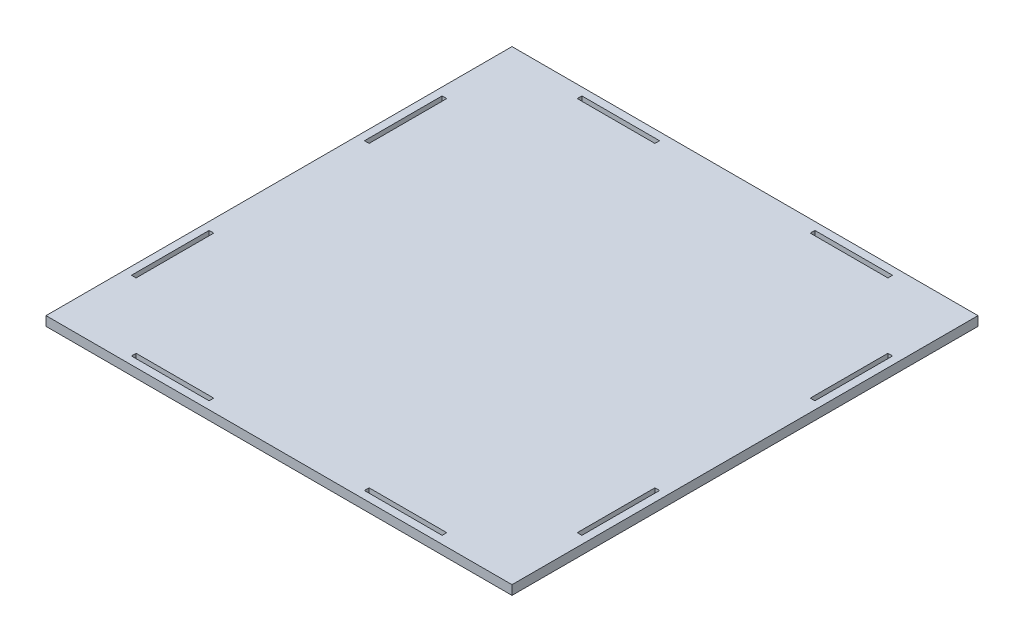
ISO-10303-21;
HEADER;
FILE_DESCRIPTION(('STEP AP214'),'2;1');
FILE_NAME('part.step','',(''),(''),'','','');
FILE_SCHEMA(('AUTOMOTIVE_DESIGN { 1 0 10303 214 1 1 1 1 }'));
ENDSEC;
DATA;
#1=APPLICATION_CONTEXT('core data for automotive mechanical design processes');
#2=APPLICATION_PROTOCOL_DEFINITION('international standard','automotive_design',2000,#1);
#3=PRODUCT_CONTEXT('',#1,'mechanical');
#4=PRODUCT('Part','Part','',(#3));
#5=PRODUCT_RELATED_PRODUCT_CATEGORY('part','',(#4));
#6=PRODUCT_DEFINITION_FORMATION('','',#4);
#7=PRODUCT_DEFINITION_CONTEXT('part definition',#1,'design');
#8=PRODUCT_DEFINITION('design','',#6,#7);
#9=PRODUCT_DEFINITION_SHAPE('','',#8);
#10=(LENGTH_UNIT() NAMED_UNIT(*) SI_UNIT(.MILLI.,.METRE.));
#11=(NAMED_UNIT(*) PLANE_ANGLE_UNIT() SI_UNIT($,.RADIAN.));
#12=(NAMED_UNIT(*) SI_UNIT($,.STERADIAN.) SOLID_ANGLE_UNIT());
#13=UNCERTAINTY_MEASURE_WITH_UNIT(LENGTH_MEASURE(1.E-05),#10,'distance_accuracy_value','');
#14=(GEOMETRIC_REPRESENTATION_CONTEXT(3) GLOBAL_UNCERTAINTY_ASSIGNED_CONTEXT((#13)) GLOBAL_UNIT_ASSIGNED_CONTEXT((#10,
#11,#12)) REPRESENTATION_CONTEXT('',''));
#15=CARTESIAN_POINT('',(0.,0.,0.));
#16=DIRECTION('',(0.,0.,1.));
#17=DIRECTION('',(1.,0.,0.));
#18=AXIS2_PLACEMENT_3D('',#15,#16,#17);
#19=CARTESIAN_POINT('',(0.,6.,0.));
#20=DIRECTION('',(0.,1.,0.));
#21=DIRECTION('',(0.,0.,1.));
#22=AXIS2_PLACEMENT_3D('',#19,#20,#21);
#23=PLANE('',#22);
#24=DIRECTION('',(0.,0.,-1.));
#25=VECTOR('',#24,1.);
#26=CARTESIAN_POINT('',(150.,6.,-150.));
#27=LINE('',#26,#25);
#28=CARTESIAN_POINT('',(150.,6.,150.));
#29=VERTEX_POINT('',#28);
#30=CARTESIAN_POINT('',(150.,6.,-150.));
#31=VERTEX_POINT('',#30);
#32=EDGE_CURVE('E518',#29,#31,#27,.T.);
#33=ORIENTED_EDGE('',*,*,#32,.T.);
#34=DIRECTION('',(-1.,0.,0.));
#35=VECTOR('',#34,1.);
#36=CARTESIAN_POINT('',(-150.,6.,-150.));
#37=LINE('',#36,#35);
#38=CARTESIAN_POINT('',(-150.,6.,-150.));
#39=VERTEX_POINT('',#38);
#40=EDGE_CURVE('E521',#31,#39,#37,.T.);
#41=ORIENTED_EDGE('',*,*,#40,.T.);
#42=DIRECTION('',(0.,0.,1.));
#43=VECTOR('',#42,1.);
#44=CARTESIAN_POINT('',(-150.,6.,-150.));
#45=LINE('',#44,#43);
#46=CARTESIAN_POINT('',(-150.,6.,150.));
#47=VERTEX_POINT('',#46);
#48=EDGE_CURVE('E524',#39,#47,#45,.T.);
#49=ORIENTED_EDGE('',*,*,#48,.T.);
#50=DIRECTION('',(1.,0.,0.));
#51=VECTOR('',#50,1.);
#52=CARTESIAN_POINT('',(-150.,6.,150.));
#53=LINE('',#52,#51);
#54=EDGE_CURVE('E526',#47,#29,#53,.T.);
#55=ORIENTED_EDGE('',*,*,#54,.T.);
#56=EDGE_LOOP('',(#33,#41,#49,#55));
#57=FACE_BOUND('',#56,.T.);
#58=DIRECTION('',(1.,0.,0.));
#59=VECTOR('',#58,1.);
#60=CARTESIAN_POINT('',(-50.,6.,-142.));
#61=LINE('',#60,#59);
#62=CARTESIAN_POINT('',(-100.,6.,-142.));
#63=VERTEX_POINT('',#62);
#64=CARTESIAN_POINT('',(-50.,6.,-142.));
#65=VERTEX_POINT('',#64);
#66=EDGE_CURVE('E489',#63,#65,#61,.T.);
#67=ORIENTED_EDGE('',*,*,#66,.F.);
#68=DIRECTION('',(0.,0.,1.));
#69=VECTOR('',#68,1.);
#70=CARTESIAN_POINT('',(-100.,6.,-142.));
#71=LINE('',#70,#69);
#72=CARTESIAN_POINT('',(-100.,6.,-145.));
#73=VERTEX_POINT('',#72);
#74=EDGE_CURVE('E487',#73,#63,#71,.T.);
#75=ORIENTED_EDGE('',*,*,#74,.F.);
#76=DIRECTION('',(-1.,0.,0.));
#77=VECTOR('',#76,1.);
#78=CARTESIAN_POINT('',(-100.,6.,-145.));
#79=LINE('',#78,#77);
#80=CARTESIAN_POINT('',(-50.,6.,-145.));
#81=VERTEX_POINT('',#80);
#82=EDGE_CURVE('E495',#81,#73,#79,.T.);
#83=ORIENTED_EDGE('',*,*,#82,.F.);
#84=DIRECTION('',(0.,0.,-1.));
#85=VECTOR('',#84,1.);
#86=CARTESIAN_POINT('',(-50.,6.,-145.));
#87=LINE('',#86,#85);
#88=EDGE_CURVE('E492',#65,#81,#87,.T.);
#89=ORIENTED_EDGE('',*,*,#88,.F.);
#90=EDGE_LOOP('',(#67,#75,#83,#89));
#91=FACE_BOUND('',#90,.T.);
#92=DIRECTION('',(0.,0.,1.));
#93=VECTOR('',#92,1.);
#94=CARTESIAN_POINT('',(50.,6.,-145.));
#95=LINE('',#94,#93);
#96=CARTESIAN_POINT('',(50.,6.,-145.));
#97=VERTEX_POINT('',#96);
#98=CARTESIAN_POINT('',(50.,6.,-142.));
#99=VERTEX_POINT('',#98);
#100=EDGE_CURVE('E458',#97,#99,#95,.T.);
#101=ORIENTED_EDGE('',*,*,#100,.F.);
#102=DIRECTION('',(-1.,0.,0.));
#103=VECTOR('',#102,1.);
#104=CARTESIAN_POINT('',(100.,6.,-145.));
#105=LINE('',#104,#103);
#106=CARTESIAN_POINT('',(100.,6.,-145.));
#107=VERTEX_POINT('',#106);
#108=EDGE_CURVE('E456',#107,#97,#105,.T.);
#109=ORIENTED_EDGE('',*,*,#108,.F.);
#110=DIRECTION('',(0.,0.,-1.));
#111=VECTOR('',#110,1.);
#112=CARTESIAN_POINT('',(100.,6.,-142.));
#113=LINE('',#112,#111);
#114=CARTESIAN_POINT('',(100.,6.,-142.));
#115=VERTEX_POINT('',#114);
#116=EDGE_CURVE('E464',#115,#107,#113,.T.);
#117=ORIENTED_EDGE('',*,*,#116,.F.);
#118=DIRECTION('',(1.,0.,0.));
#119=VECTOR('',#118,1.);
#120=CARTESIAN_POINT('',(50.,6.,-142.));
#121=LINE('',#120,#119);
#122=EDGE_CURVE('E461',#99,#115,#121,.T.);
#123=ORIENTED_EDGE('',*,*,#122,.F.);
#124=EDGE_LOOP('',(#101,#109,#117,#123));
#125=FACE_BOUND('',#124,.T.);
#126=DIRECTION('',(0.,0.,-1.));
#127=VECTOR('',#126,1.);
#128=CARTESIAN_POINT('',(145.,6.,100.));
#129=LINE('',#128,#127);
#130=CARTESIAN_POINT('',(145.,6.,100.));
#131=VERTEX_POINT('',#130);
#132=CARTESIAN_POINT('',(145.,6.,50.));
#133=VERTEX_POINT('',#132);
#134=EDGE_CURVE('E427',#131,#133,#129,.T.);
#135=ORIENTED_EDGE('',*,*,#134,.F.);
#136=DIRECTION('',(1.,0.,0.));
#137=VECTOR('',#136,1.);
#138=CARTESIAN_POINT('',(145.,6.,100.));
#139=LINE('',#138,#137);
#140=CARTESIAN_POINT('',(142.,6.,100.));
#141=VERTEX_POINT('',#140);
#142=EDGE_CURVE('E425',#141,#131,#139,.T.);
#143=ORIENTED_EDGE('',*,*,#142,.F.);
#144=DIRECTION('',(0.,0.,1.));
#145=VECTOR('',#144,1.);
#146=CARTESIAN_POINT('',(142.,6.,100.));
#147=LINE('',#146,#145);
#148=CARTESIAN_POINT('',(142.,6.,50.));
#149=VERTEX_POINT('',#148);
#150=EDGE_CURVE('E433',#149,#141,#147,.T.);
#151=ORIENTED_EDGE('',*,*,#150,.F.);
#152=DIRECTION('',(-1.,0.,0.));
#153=VECTOR('',#152,1.);
#154=CARTESIAN_POINT('',(142.,6.,50.));
#155=LINE('',#154,#153);
#156=EDGE_CURVE('E430',#133,#149,#155,.T.);
#157=ORIENTED_EDGE('',*,*,#156,.F.);
#158=EDGE_LOOP('',(#135,#143,#151,#157));
#159=FACE_BOUND('',#158,.T.);
#160=DIRECTION('',(0.,0.,-1.));
#161=VECTOR('',#160,1.);
#162=CARTESIAN_POINT('',(145.,6.,-100.));
#163=LINE('',#162,#161);
#164=CARTESIAN_POINT('',(145.,6.,-50.));
#165=VERTEX_POINT('',#164);
#166=CARTESIAN_POINT('',(145.,6.,-100.));
#167=VERTEX_POINT('',#166);
#168=EDGE_CURVE('E396',#165,#167,#163,.T.);
#169=ORIENTED_EDGE('',*,*,#168,.F.);
#170=DIRECTION('',(1.,0.,0.));
#171=VECTOR('',#170,1.);
#172=CARTESIAN_POINT('',(145.,6.,-50.));
#173=LINE('',#172,#171);
#174=CARTESIAN_POINT('',(142.,6.,-50.));
#175=VERTEX_POINT('',#174);
#176=EDGE_CURVE('E394',#175,#165,#173,.T.);
#177=ORIENTED_EDGE('',*,*,#176,.F.);
#178=DIRECTION('',(0.,0.,1.));
#179=VECTOR('',#178,1.);
#180=CARTESIAN_POINT('',(142.,6.,-50.));
#181=LINE('',#180,#179);
#182=CARTESIAN_POINT('',(142.,6.,-100.));
#183=VERTEX_POINT('',#182);
#184=EDGE_CURVE('E402',#183,#175,#181,.T.);
#185=ORIENTED_EDGE('',*,*,#184,.F.);
#186=DIRECTION('',(-1.,0.,0.));
#187=VECTOR('',#186,1.);
#188=CARTESIAN_POINT('',(142.,6.,-100.));
#189=LINE('',#188,#187);
#190=EDGE_CURVE('E399',#167,#183,#189,.T.);
#191=ORIENTED_EDGE('',*,*,#190,.F.);
#192=EDGE_LOOP('',(#169,#177,#185,#191));
#193=FACE_BOUND('',#192,.T.);
#194=DIRECTION('',(-1.,0.,0.));
#195=VECTOR('',#194,1.);
#196=CARTESIAN_POINT('',(-142.,6.,50.));
#197=LINE('',#196,#195);
#198=CARTESIAN_POINT('',(-142.,6.,50.));
#199=VERTEX_POINT('',#198);
#200=CARTESIAN_POINT('',(-145.,6.,50.));
#201=VERTEX_POINT('',#200);
#202=EDGE_CURVE('E365',#199,#201,#197,.T.);
#203=ORIENTED_EDGE('',*,*,#202,.F.);
#204=DIRECTION('',(0.,0.,-1.));
#205=VECTOR('',#204,1.);
#206=CARTESIAN_POINT('',(-142.,6.,100.));
#207=LINE('',#206,#205);
#208=CARTESIAN_POINT('',(-142.,6.,100.));
#209=VERTEX_POINT('',#208);
#210=EDGE_CURVE('E363',#209,#199,#207,.T.);
#211=ORIENTED_EDGE('',*,*,#210,.F.);
#212=DIRECTION('',(1.,0.,0.));
#213=VECTOR('',#212,1.);
#214=CARTESIAN_POINT('',(-145.,6.,100.));
#215=LINE('',#214,#213);
#216=CARTESIAN_POINT('',(-145.,6.,100.));
#217=VERTEX_POINT('',#216);
#218=EDGE_CURVE('E371',#217,#209,#215,.T.);
#219=ORIENTED_EDGE('',*,*,#218,.F.);
#220=DIRECTION('',(0.,0.,1.));
#221=VECTOR('',#220,1.);
#222=CARTESIAN_POINT('',(-145.,6.,50.));
#223=LINE('',#222,#221);
#224=EDGE_CURVE('E368',#201,#217,#223,.T.);
#225=ORIENTED_EDGE('',*,*,#224,.F.);
#226=EDGE_LOOP('',(#203,#211,#219,#225));
#227=FACE_BOUND('',#226,.T.);
#228=DIRECTION('',(0.,0.,1.));
#229=VECTOR('',#228,1.);
#230=CARTESIAN_POINT('',(50.,6.,142.));
#231=LINE('',#230,#229);
#232=CARTESIAN_POINT('',(50.,6.,142.));
#233=VERTEX_POINT('',#232);
#234=CARTESIAN_POINT('',(50.,6.,145.));
#235=VERTEX_POINT('',#234);
#236=EDGE_CURVE('E334',#233,#235,#231,.T.);
#237=ORIENTED_EDGE('',*,*,#236,.F.);
#238=DIRECTION('',(-1.,0.,0.));
#239=VECTOR('',#238,1.);
#240=CARTESIAN_POINT('',(100.,6.,142.));
#241=LINE('',#240,#239);
#242=CARTESIAN_POINT('',(100.,6.,142.));
#243=VERTEX_POINT('',#242);
#244=EDGE_CURVE('E332',#243,#233,#241,.T.);
#245=ORIENTED_EDGE('',*,*,#244,.F.);
#246=DIRECTION('',(0.,0.,-1.));
#247=VECTOR('',#246,1.);
#248=CARTESIAN_POINT('',(100.,6.,145.));
#249=LINE('',#248,#247);
#250=CARTESIAN_POINT('',(100.,6.,145.));
#251=VERTEX_POINT('',#250);
#252=EDGE_CURVE('E340',#251,#243,#249,.T.);
#253=ORIENTED_EDGE('',*,*,#252,.F.);
#254=DIRECTION('',(1.,0.,0.));
#255=VECTOR('',#254,1.);
#256=CARTESIAN_POINT('',(50.,6.,145.));
#257=LINE('',#256,#255);
#258=EDGE_CURVE('E337',#235,#251,#257,.T.);
#259=ORIENTED_EDGE('',*,*,#258,.F.);
#260=EDGE_LOOP('',(#237,#245,#253,#259));
#261=FACE_BOUND('',#260,.T.);
#262=DIRECTION('',(-1.,0.,0.));
#263=VECTOR('',#262,1.);
#264=CARTESIAN_POINT('',(-50.,6.,142.));
#265=LINE('',#264,#263);
#266=CARTESIAN_POINT('',(-50.,6.,142.));
#267=VERTEX_POINT('',#266);
#268=CARTESIAN_POINT('',(-100.,6.,142.));
#269=VERTEX_POINT('',#268);
#270=EDGE_CURVE('E303',#267,#269,#265,.T.);
#271=ORIENTED_EDGE('',*,*,#270,.F.);
#272=DIRECTION('',(0.,0.,-1.));
#273=VECTOR('',#272,1.);
#274=CARTESIAN_POINT('',(-50.,6.,145.));
#275=LINE('',#274,#273);
#276=CARTESIAN_POINT('',(-50.,6.,145.));
#277=VERTEX_POINT('',#276);
#278=EDGE_CURVE('E301',#277,#267,#275,.T.);
#279=ORIENTED_EDGE('',*,*,#278,.F.);
#280=DIRECTION('',(1.,0.,0.));
#281=VECTOR('',#280,1.);
#282=CARTESIAN_POINT('',(-100.,6.,145.));
#283=LINE('',#282,#281);
#284=CARTESIAN_POINT('',(-100.,6.,145.));
#285=VERTEX_POINT('',#284);
#286=EDGE_CURVE('E309',#285,#277,#283,.T.);
#287=ORIENTED_EDGE('',*,*,#286,.F.);
#288=DIRECTION('',(0.,0.,1.));
#289=VECTOR('',#288,1.);
#290=CARTESIAN_POINT('',(-100.,6.,142.));
#291=LINE('',#290,#289);
#292=EDGE_CURVE('E306',#269,#285,#291,.T.);
#293=ORIENTED_EDGE('',*,*,#292,.F.);
#294=EDGE_LOOP('',(#271,#279,#287,#293));
#295=FACE_BOUND('',#294,.T.);
#296=DIRECTION('',(-1.,0.,0.));
#297=VECTOR('',#296,1.);
#298=CARTESIAN_POINT('',(-145.,6.,-100.));
#299=LINE('',#298,#297);
#300=CARTESIAN_POINT('',(-142.,6.,-100.));
#301=VERTEX_POINT('',#300);
#302=CARTESIAN_POINT('',(-145.,6.,-100.));
#303=VERTEX_POINT('',#302);
#304=EDGE_CURVE('E273',#301,#303,#299,.T.);
#305=ORIENTED_EDGE('',*,*,#304,.F.);
#306=DIRECTION('',(0.,0.,-1.));
#307=VECTOR('',#306,1.);
#308=CARTESIAN_POINT('',(-142.,6.,-100.));
#309=LINE('',#308,#307);
#310=CARTESIAN_POINT('',(-142.,6.,-50.));
#311=VERTEX_POINT('',#310);
#312=EDGE_CURVE('E265',#311,#301,#309,.T.);
#313=ORIENTED_EDGE('',*,*,#312,.F.);
#314=DIRECTION('',(1.,0.,0.));
#315=VECTOR('',#314,1.);
#316=CARTESIAN_POINT('',(-142.,6.,-50.));
#317=LINE('',#316,#315);
#318=CARTESIAN_POINT('',(-145.,6.,-50.));
#319=VERTEX_POINT('',#318);
#320=EDGE_CURVE('E287',#319,#311,#317,.T.);
#321=ORIENTED_EDGE('',*,*,#320,.F.);
#322=DIRECTION('',(0.,0.,1.));
#323=VECTOR('',#322,1.);
#324=CARTESIAN_POINT('',(-145.,6.,-50.));
#325=LINE('',#324,#323);
#326=EDGE_CURVE('E285',#303,#319,#325,.T.);
#327=ORIENTED_EDGE('',*,*,#326,.F.);
#328=EDGE_LOOP('',(#305,#313,#321,#327));
#329=FACE_BOUND('',#328,.T.);
#330=ADVANCED_FACE('F32',(#57,#91,#125,#159,#193,#227,#261,#295,#329),#23,.T.);
#331=CARTESIAN_POINT('',(0.,0.,0.));
#332=DIRECTION('',(0.,1.,0.));
#333=DIRECTION('',(0.,0.,1.));
#334=AXIS2_PLACEMENT_3D('',#331,#332,#333);
#335=PLANE('',#334);
#336=DIRECTION('',(0.,0.,-1.));
#337=VECTOR('',#336,1.);
#338=CARTESIAN_POINT('',(-50.,0.,145.));
#339=LINE('',#338,#337);
#340=CARTESIAN_POINT('',(-50.,0.,145.));
#341=VERTEX_POINT('',#340);
#342=CARTESIAN_POINT('',(-50.,0.,142.));
#343=VERTEX_POINT('',#342);
#344=EDGE_CURVE('E281',#341,#343,#339,.T.);
#345=ORIENTED_EDGE('',*,*,#344,.T.);
#346=DIRECTION('',(-1.,0.,0.));
#347=VECTOR('',#346,1.);
#348=CARTESIAN_POINT('',(-50.,0.,142.));
#349=LINE('',#348,#347);
#350=CARTESIAN_POINT('',(-100.,0.,142.));
#351=VERTEX_POINT('',#350);
#352=EDGE_CURVE('E314',#343,#351,#349,.T.);
#353=ORIENTED_EDGE('',*,*,#352,.T.);
#354=DIRECTION('',(0.,0.,1.));
#355=VECTOR('',#354,1.);
#356=CARTESIAN_POINT('',(-100.,0.,142.));
#357=LINE('',#356,#355);
#358=CARTESIAN_POINT('',(-100.,0.,145.));
#359=VERTEX_POINT('',#358);
#360=EDGE_CURVE('E317',#351,#359,#357,.T.);
#361=ORIENTED_EDGE('',*,*,#360,.T.);
#362=DIRECTION('',(1.,0.,0.));
#363=VECTOR('',#362,1.);
#364=CARTESIAN_POINT('',(-100.,0.,145.));
#365=LINE('',#364,#363);
#366=EDGE_CURVE('E304',#359,#341,#365,.T.);
#367=ORIENTED_EDGE('',*,*,#366,.T.);
#368=EDGE_LOOP('',(#345,#353,#361,#367));
#369=FACE_BOUND('',#368,.T.);
#370=DIRECTION('',(0.,0.,-1.));
#371=VECTOR('',#370,1.);
#372=CARTESIAN_POINT('',(-142.,0.,100.));
#373=LINE('',#372,#371);
#374=CARTESIAN_POINT('',(-142.,0.,100.));
#375=VERTEX_POINT('',#374);
#376=CARTESIAN_POINT('',(-142.,0.,50.));
#377=VERTEX_POINT('',#376);
#378=EDGE_CURVE('E362',#375,#377,#373,.T.);
#379=ORIENTED_EDGE('',*,*,#378,.T.);
#380=DIRECTION('',(-1.,0.,0.));
#381=VECTOR('',#380,1.);
#382=CARTESIAN_POINT('',(-142.,0.,50.));
#383=LINE('',#382,#381);
#384=CARTESIAN_POINT('',(-145.,0.,50.));
#385=VERTEX_POINT('',#384);
#386=EDGE_CURVE('E376',#377,#385,#383,.T.);
#387=ORIENTED_EDGE('',*,*,#386,.T.);
#388=DIRECTION('',(0.,0.,1.));
#389=VECTOR('',#388,1.);
#390=CARTESIAN_POINT('',(-145.,0.,50.));
#391=LINE('',#390,#389);
#392=CARTESIAN_POINT('',(-145.,0.,100.));
#393=VERTEX_POINT('',#392);
#394=EDGE_CURVE('E379',#385,#393,#391,.T.);
#395=ORIENTED_EDGE('',*,*,#394,.T.);
#396=DIRECTION('',(1.,0.,0.));
#397=VECTOR('',#396,1.);
#398=CARTESIAN_POINT('',(-145.,0.,100.));
#399=LINE('',#398,#397);
#400=EDGE_CURVE('E366',#393,#375,#399,.T.);
#401=ORIENTED_EDGE('',*,*,#400,.T.);
#402=EDGE_LOOP('',(#379,#387,#395,#401));
#403=FACE_BOUND('',#402,.T.);
#404=DIRECTION('',(1.,0.,0.));
#405=VECTOR('',#404,1.);
#406=CARTESIAN_POINT('',(145.,0.,100.));
#407=LINE('',#406,#405);
#408=CARTESIAN_POINT('',(142.,0.,100.));
#409=VERTEX_POINT('',#408);
#410=CARTESIAN_POINT('',(145.,0.,100.));
#411=VERTEX_POINT('',#410);
#412=EDGE_CURVE('E424',#409,#411,#407,.T.);
#413=ORIENTED_EDGE('',*,*,#412,.T.);
#414=DIRECTION('',(0.,0.,-1.));
#415=VECTOR('',#414,1.);
#416=CARTESIAN_POINT('',(145.,0.,100.));
#417=LINE('',#416,#415);
#418=CARTESIAN_POINT('',(145.,0.,50.));
#419=VERTEX_POINT('',#418);
#420=EDGE_CURVE('E438',#411,#419,#417,.T.);
#421=ORIENTED_EDGE('',*,*,#420,.T.);
#422=DIRECTION('',(-1.,0.,0.));
#423=VECTOR('',#422,1.);
#424=CARTESIAN_POINT('',(142.,0.,50.));
#425=LINE('',#424,#423);
#426=CARTESIAN_POINT('',(142.,0.,50.));
#427=VERTEX_POINT('',#426);
#428=EDGE_CURVE('E441',#419,#427,#425,.T.);
#429=ORIENTED_EDGE('',*,*,#428,.T.);
#430=DIRECTION('',(0.,0.,1.));
#431=VECTOR('',#430,1.);
#432=CARTESIAN_POINT('',(142.,0.,100.));
#433=LINE('',#432,#431);
#434=EDGE_CURVE('E428',#427,#409,#433,.T.);
#435=ORIENTED_EDGE('',*,*,#434,.T.);
#436=EDGE_LOOP('',(#413,#421,#429,#435));
#437=FACE_BOUND('',#436,.T.);
#438=DIRECTION('',(0.,0.,1.));
#439=VECTOR('',#438,1.);
#440=CARTESIAN_POINT('',(-100.,0.,-142.));
#441=LINE('',#440,#439);
#442=CARTESIAN_POINT('',(-100.,0.,-145.));
#443=VERTEX_POINT('',#442);
#444=CARTESIAN_POINT('',(-100.,0.,-142.));
#445=VERTEX_POINT('',#444);
#446=EDGE_CURVE('E486',#443,#445,#441,.T.);
#447=ORIENTED_EDGE('',*,*,#446,.T.);
#448=DIRECTION('',(1.,0.,0.));
#449=VECTOR('',#448,1.);
#450=CARTESIAN_POINT('',(-50.,0.,-142.));
#451=LINE('',#450,#449);
#452=CARTESIAN_POINT('',(-50.,0.,-142.));
#453=VERTEX_POINT('',#452);
#454=EDGE_CURVE('E500',#445,#453,#451,.T.);
#455=ORIENTED_EDGE('',*,*,#454,.T.);
#456=DIRECTION('',(0.,0.,-1.));
#457=VECTOR('',#456,1.);
#458=CARTESIAN_POINT('',(-50.,0.,-145.));
#459=LINE('',#458,#457);
#460=CARTESIAN_POINT('',(-50.,0.,-145.));
#461=VERTEX_POINT('',#460);
#462=EDGE_CURVE('E503',#453,#461,#459,.T.);
#463=ORIENTED_EDGE('',*,*,#462,.T.);
#464=DIRECTION('',(-1.,0.,0.));
#465=VECTOR('',#464,1.);
#466=CARTESIAN_POINT('',(-100.,0.,-145.));
#467=LINE('',#466,#465);
#468=EDGE_CURVE('E490',#461,#443,#467,.T.);
#469=ORIENTED_EDGE('',*,*,#468,.T.);
#470=EDGE_LOOP('',(#447,#455,#463,#469));
#471=FACE_BOUND('',#470,.T.);
#472=DIRECTION('',(0.,0.,-1.));
#473=VECTOR('',#472,1.);
#474=CARTESIAN_POINT('',(150.,0.,-150.));
#475=LINE('',#474,#473);
#476=CARTESIAN_POINT('',(150.,0.,150.));
#477=VERTEX_POINT('',#476);
#478=CARTESIAN_POINT('',(150.,0.,-150.));
#479=VERTEX_POINT('',#478);
#480=EDGE_CURVE('E517',#477,#479,#475,.T.);
#481=ORIENTED_EDGE('',*,*,#480,.F.);
#482=DIRECTION('',(1.,0.,0.));
#483=VECTOR('',#482,1.);
#484=CARTESIAN_POINT('',(-150.,0.,150.));
#485=LINE('',#484,#483);
#486=CARTESIAN_POINT('',(-150.,0.,150.));
#487=VERTEX_POINT('',#486);
#488=EDGE_CURVE('E522',#487,#477,#485,.T.);
#489=ORIENTED_EDGE('',*,*,#488,.F.);
#490=DIRECTION('',(0.,0.,1.));
#491=VECTOR('',#490,1.);
#492=CARTESIAN_POINT('',(-150.,0.,-150.));
#493=LINE('',#492,#491);
#494=CARTESIAN_POINT('',(-150.,0.,-150.));
#495=VERTEX_POINT('',#494);
#496=EDGE_CURVE('E533',#495,#487,#493,.T.);
#497=ORIENTED_EDGE('',*,*,#496,.F.);
#498=DIRECTION('',(-1.,0.,0.));
#499=VECTOR('',#498,1.);
#500=CARTESIAN_POINT('',(-150.,0.,-150.));
#501=LINE('',#500,#499);
#502=EDGE_CURVE('E531',#479,#495,#501,.T.);
#503=ORIENTED_EDGE('',*,*,#502,.F.);
#504=EDGE_LOOP('',(#481,#489,#497,#503));
#505=FACE_BOUND('',#504,.T.);
#506=DIRECTION('',(-1.,0.,0.));
#507=VECTOR('',#506,1.);
#508=CARTESIAN_POINT('',(100.,0.,-145.));
#509=LINE('',#508,#507);
#510=CARTESIAN_POINT('',(100.,0.,-145.));
#511=VERTEX_POINT('',#510);
#512=CARTESIAN_POINT('',(50.,0.,-145.));
#513=VERTEX_POINT('',#512);
#514=EDGE_CURVE('E455',#511,#513,#509,.T.);
#515=ORIENTED_EDGE('',*,*,#514,.T.);
#516=DIRECTION('',(0.,0.,1.));
#517=VECTOR('',#516,1.);
#518=CARTESIAN_POINT('',(50.,0.,-145.));
#519=LINE('',#518,#517);
#520=CARTESIAN_POINT('',(50.,0.,-142.));
#521=VERTEX_POINT('',#520);
#522=EDGE_CURVE('E469',#513,#521,#519,.T.);
#523=ORIENTED_EDGE('',*,*,#522,.T.);
#524=DIRECTION('',(1.,0.,0.));
#525=VECTOR('',#524,1.);
#526=CARTESIAN_POINT('',(50.,0.,-142.));
#527=LINE('',#526,#525);
#528=CARTESIAN_POINT('',(100.,0.,-142.));
#529=VERTEX_POINT('',#528);
#530=EDGE_CURVE('E472',#521,#529,#527,.T.);
#531=ORIENTED_EDGE('',*,*,#530,.T.);
#532=DIRECTION('',(0.,0.,-1.));
#533=VECTOR('',#532,1.);
#534=CARTESIAN_POINT('',(100.,0.,-142.));
#535=LINE('',#534,#533);
#536=EDGE_CURVE('E459',#529,#511,#535,.T.);
#537=ORIENTED_EDGE('',*,*,#536,.T.);
#538=EDGE_LOOP('',(#515,#523,#531,#537));
#539=FACE_BOUND('',#538,.T.);
#540=DIRECTION('',(1.,0.,0.));
#541=VECTOR('',#540,1.);
#542=CARTESIAN_POINT('',(145.,0.,-50.));
#543=LINE('',#542,#541);
#544=CARTESIAN_POINT('',(142.,0.,-50.));
#545=VERTEX_POINT('',#544);
#546=CARTESIAN_POINT('',(145.,0.,-50.));
#547=VERTEX_POINT('',#546);
#548=EDGE_CURVE('E393',#545,#547,#543,.T.);
#549=ORIENTED_EDGE('',*,*,#548,.T.);
#550=DIRECTION('',(0.,0.,-1.));
#551=VECTOR('',#550,1.);
#552=CARTESIAN_POINT('',(145.,0.,-100.));
#553=LINE('',#552,#551);
#554=CARTESIAN_POINT('',(145.,0.,-100.));
#555=VERTEX_POINT('',#554);
#556=EDGE_CURVE('E407',#547,#555,#553,.T.);
#557=ORIENTED_EDGE('',*,*,#556,.T.);
#558=DIRECTION('',(-1.,0.,0.));
#559=VECTOR('',#558,1.);
#560=CARTESIAN_POINT('',(142.,0.,-100.));
#561=LINE('',#560,#559);
#562=CARTESIAN_POINT('',(142.,0.,-100.));
#563=VERTEX_POINT('',#562);
#564=EDGE_CURVE('E410',#555,#563,#561,.T.);
#565=ORIENTED_EDGE('',*,*,#564,.T.);
#566=DIRECTION('',(0.,0.,1.));
#567=VECTOR('',#566,1.);
#568=CARTESIAN_POINT('',(142.,0.,-50.));
#569=LINE('',#568,#567);
#570=EDGE_CURVE('E397',#563,#545,#569,.T.);
#571=ORIENTED_EDGE('',*,*,#570,.T.);
#572=EDGE_LOOP('',(#549,#557,#565,#571));
#573=FACE_BOUND('',#572,.T.);
#574=DIRECTION('',(-1.,0.,0.));
#575=VECTOR('',#574,1.);
#576=CARTESIAN_POINT('',(100.,0.,142.));
#577=LINE('',#576,#575);
#578=CARTESIAN_POINT('',(100.,0.,142.));
#579=VERTEX_POINT('',#578);
#580=CARTESIAN_POINT('',(50.,0.,142.));
#581=VERTEX_POINT('',#580);
#582=EDGE_CURVE('E331',#579,#581,#577,.T.);
#583=ORIENTED_EDGE('',*,*,#582,.T.);
#584=DIRECTION('',(0.,0.,1.));
#585=VECTOR('',#584,1.);
#586=CARTESIAN_POINT('',(50.,0.,142.));
#587=LINE('',#586,#585);
#588=CARTESIAN_POINT('',(50.,0.,145.));
#589=VERTEX_POINT('',#588);
#590=EDGE_CURVE('E345',#581,#589,#587,.T.);
#591=ORIENTED_EDGE('',*,*,#590,.T.);
#592=DIRECTION('',(1.,0.,0.));
#593=VECTOR('',#592,1.);
#594=CARTESIAN_POINT('',(50.,0.,145.));
#595=LINE('',#594,#593);
#596=CARTESIAN_POINT('',(100.,0.,145.));
#597=VERTEX_POINT('',#596);
#598=EDGE_CURVE('E348',#589,#597,#595,.T.);
#599=ORIENTED_EDGE('',*,*,#598,.T.);
#600=DIRECTION('',(0.,0.,-1.));
#601=VECTOR('',#600,1.);
#602=CARTESIAN_POINT('',(100.,0.,145.));
#603=LINE('',#602,#601);
#604=EDGE_CURVE('E335',#597,#579,#603,.T.);
#605=ORIENTED_EDGE('',*,*,#604,.T.);
#606=EDGE_LOOP('',(#583,#591,#599,#605));
#607=FACE_BOUND('',#606,.T.);
#608=DIRECTION('',(0.,0.,-1.));
#609=VECTOR('',#608,1.);
#610=CARTESIAN_POINT('',(-142.,0.,-100.));
#611=LINE('',#610,#609);
#612=CARTESIAN_POINT('',(-142.,0.,-50.));
#613=VERTEX_POINT('',#612);
#614=CARTESIAN_POINT('',(-142.,0.,-100.));
#615=VERTEX_POINT('',#614);
#616=EDGE_CURVE('E55',#613,#615,#611,.T.);
#617=ORIENTED_EDGE('',*,*,#616,.T.);
#618=DIRECTION('',(-1.,0.,0.));
#619=VECTOR('',#618,1.);
#620=CARTESIAN_POINT('',(-145.,0.,-100.));
#621=LINE('',#620,#619);
#622=CARTESIAN_POINT('',(-145.,0.,-100.));
#623=VERTEX_POINT('',#622);
#624=EDGE_CURVE('E280',#615,#623,#621,.T.);
#625=ORIENTED_EDGE('',*,*,#624,.T.);
#626=DIRECTION('',(0.,0.,1.));
#627=VECTOR('',#626,1.);
#628=CARTESIAN_POINT('',(-145.,0.,-50.));
#629=LINE('',#628,#627);
#630=CARTESIAN_POINT('',(-145.,0.,-50.));
#631=VERTEX_POINT('',#630);
#632=EDGE_CURVE('E293',#623,#631,#629,.T.);
#633=ORIENTED_EDGE('',*,*,#632,.T.);
#634=DIRECTION('',(1.,0.,0.));
#635=VECTOR('',#634,1.);
#636=CARTESIAN_POINT('',(-142.,0.,-50.));
#637=LINE('',#636,#635);
#638=EDGE_CURVE('E274',#631,#613,#637,.T.);
#639=ORIENTED_EDGE('',*,*,#638,.T.);
#640=EDGE_LOOP('',(#617,#625,#633,#639));
#641=FACE_BOUND('',#640,.T.);
#642=ADVANCED_FACE('F551',(#369,#403,#437,#471,#505,#539,#573,#607,#641),#335,.F.);
#643=CARTESIAN_POINT('',(150.,6.,-150.));
#644=DIRECTION('',(-1.,0.,0.));
#645=DIRECTION('',(0.,0.,1.));
#646=AXIS2_PLACEMENT_3D('',#643,#644,#645);
#647=PLANE('',#646);
#648=ORIENTED_EDGE('',*,*,#480,.T.);
#649=DIRECTION('',(0.,-1.,0.));
#650=VECTOR('',#649,1.);
#651=CARTESIAN_POINT('',(150.,6.,-150.));
#652=LINE('',#651,#650);
#653=EDGE_CURVE('E11',#31,#479,#652,.T.);
#654=ORIENTED_EDGE('',*,*,#653,.F.);
#655=ORIENTED_EDGE('',*,*,#32,.F.);
#656=DIRECTION('',(0.,-1.,0.));
#657=VECTOR('',#656,1.);
#658=CARTESIAN_POINT('',(150.,6.,150.));
#659=LINE('',#658,#657);
#660=EDGE_CURVE('E528',#29,#477,#659,.T.);
#661=ORIENTED_EDGE('',*,*,#660,.T.);
#662=EDGE_LOOP('',(#648,#654,#655,#661));
#663=FACE_BOUND('',#662,.T.);
#664=ADVANCED_FACE('F34',(#663),#647,.F.);
#665=CARTESIAN_POINT('',(-150.,6.,-150.));
#666=DIRECTION('',(0.,0.,1.));
#667=DIRECTION('',(1.,0.,0.));
#668=AXIS2_PLACEMENT_3D('',#665,#666,#667);
#669=PLANE('',#668);
#670=ORIENTED_EDGE('',*,*,#502,.T.);
#671=DIRECTION('',(0.,-1.,0.));
#672=VECTOR('',#671,1.);
#673=CARTESIAN_POINT('',(-150.,6.,-150.));
#674=LINE('',#673,#672);
#675=EDGE_CURVE('E40',#39,#495,#674,.T.);
#676=ORIENTED_EDGE('',*,*,#675,.F.);
#677=ORIENTED_EDGE('',*,*,#40,.F.);
#678=ORIENTED_EDGE('',*,*,#653,.T.);
#679=EDGE_LOOP('',(#670,#676,#677,#678));
#680=FACE_BOUND('',#679,.T.);
#681=ADVANCED_FACE('F562',(#680),#669,.F.);
#682=CARTESIAN_POINT('',(-150.,6.,-150.));
#683=DIRECTION('',(1.,0.,0.));
#684=DIRECTION('',(0.,0.,-1.));
#685=AXIS2_PLACEMENT_3D('',#682,#683,#684);
#686=PLANE('',#685);
#687=ORIENTED_EDGE('',*,*,#496,.T.);
#688=DIRECTION('',(0.,-1.,0.));
#689=VECTOR('',#688,1.);
#690=CARTESIAN_POINT('',(-150.,6.,150.));
#691=LINE('',#690,#689);
#692=EDGE_CURVE('E538',#47,#487,#691,.T.);
#693=ORIENTED_EDGE('',*,*,#692,.F.);
#694=ORIENTED_EDGE('',*,*,#48,.F.);
#695=ORIENTED_EDGE('',*,*,#675,.T.);
#696=EDGE_LOOP('',(#687,#693,#694,#695));
#697=FACE_BOUND('',#696,.T.);
#698=ADVANCED_FACE('F545',(#697),#686,.F.);
#699=CARTESIAN_POINT('',(-150.,6.,150.));
#700=DIRECTION('',(0.,0.,-1.));
#701=DIRECTION('',(-1.,0.,0.));
#702=AXIS2_PLACEMENT_3D('',#699,#700,#701);
#703=PLANE('',#702);
#704=ORIENTED_EDGE('',*,*,#488,.T.);
#705=ORIENTED_EDGE('',*,*,#660,.F.);
#706=ORIENTED_EDGE('',*,*,#54,.F.);
#707=ORIENTED_EDGE('',*,*,#692,.T.);
#708=EDGE_LOOP('',(#704,#705,#706,#707));
#709=FACE_BOUND('',#708,.T.);
#710=ADVANCED_FACE('F555',(#709),#703,.F.);
#711=CARTESIAN_POINT('',(-100.,6.,-142.));
#712=DIRECTION('',(1.,0.,0.));
#713=DIRECTION('',(0.,0.,-1.));
#714=AXIS2_PLACEMENT_3D('',#711,#712,#713);
#715=PLANE('',#714);
#716=ORIENTED_EDGE('',*,*,#446,.F.);
#717=DIRECTION('',(0.,-1.,0.));
#718=VECTOR('',#717,1.);
#719=CARTESIAN_POINT('',(-100.,6.,-145.));
#720=LINE('',#719,#718);
#721=EDGE_CURVE('E497',#73,#443,#720,.T.);
#722=ORIENTED_EDGE('',*,*,#721,.F.);
#723=ORIENTED_EDGE('',*,*,#74,.T.);
#724=DIRECTION('',(0.,-1.,0.));
#725=VECTOR('',#724,1.);
#726=CARTESIAN_POINT('',(-100.,6.,-142.));
#727=LINE('',#726,#725);
#728=EDGE_CURVE('E514',#63,#445,#727,.T.);
#729=ORIENTED_EDGE('',*,*,#728,.T.);
#730=EDGE_LOOP('',(#716,#722,#723,#729));
#731=FACE_BOUND('',#730,.T.);
#732=ADVANCED_FACE('F577',(#731),#715,.T.);
#733=CARTESIAN_POINT('',(-50.,6.,-142.));
#734=DIRECTION('',(0.,0.,-1.));
#735=DIRECTION('',(-1.,0.,0.));
#736=AXIS2_PLACEMENT_3D('',#733,#734,#735);
#737=PLANE('',#736);
#738=ORIENTED_EDGE('',*,*,#454,.F.);
#739=ORIENTED_EDGE('',*,*,#728,.F.);
#740=ORIENTED_EDGE('',*,*,#66,.T.);
#741=DIRECTION('',(0.,-1.,0.));
#742=VECTOR('',#741,1.);
#743=CARTESIAN_POINT('',(-50.,6.,-142.));
#744=LINE('',#743,#742);
#745=EDGE_CURVE('E512',#65,#453,#744,.T.);
#746=ORIENTED_EDGE('',*,*,#745,.T.);
#747=EDGE_LOOP('',(#738,#739,#740,#746));
#748=FACE_BOUND('',#747,.T.);
#749=ADVANCED_FACE('F584',(#748),#737,.T.);
#750=CARTESIAN_POINT('',(-50.,6.,-145.));
#751=DIRECTION('',(-1.,0.,0.));
#752=DIRECTION('',(0.,0.,1.));
#753=AXIS2_PLACEMENT_3D('',#750,#751,#752);
#754=PLANE('',#753);
#755=ORIENTED_EDGE('',*,*,#462,.F.);
#756=ORIENTED_EDGE('',*,*,#745,.F.);
#757=ORIENTED_EDGE('',*,*,#88,.T.);
#758=DIRECTION('',(0.,-1.,0.));
#759=VECTOR('',#758,1.);
#760=CARTESIAN_POINT('',(-50.,6.,-145.));
#761=LINE('',#760,#759);
#762=EDGE_CURVE('E510',#81,#461,#761,.T.);
#763=ORIENTED_EDGE('',*,*,#762,.T.);
#764=EDGE_LOOP('',(#755,#756,#757,#763));
#765=FACE_BOUND('',#764,.T.);
#766=ADVANCED_FACE('F589',(#765),#754,.T.);
#767=CARTESIAN_POINT('',(-100.,6.,-145.));
#768=DIRECTION('',(0.,0.,1.));
#769=DIRECTION('',(1.,0.,0.));
#770=AXIS2_PLACEMENT_3D('',#767,#768,#769);
#771=PLANE('',#770);
#772=ORIENTED_EDGE('',*,*,#468,.F.);
#773=ORIENTED_EDGE('',*,*,#762,.F.);
#774=ORIENTED_EDGE('',*,*,#82,.T.);
#775=ORIENTED_EDGE('',*,*,#721,.T.);
#776=EDGE_LOOP('',(#772,#773,#774,#775));
#777=FACE_BOUND('',#776,.T.);
#778=ADVANCED_FACE('F597',(#777),#771,.T.);
#779=CARTESIAN_POINT('',(100.,6.,-145.));
#780=DIRECTION('',(0.,0.,1.));
#781=DIRECTION('',(1.,0.,0.));
#782=AXIS2_PLACEMENT_3D('',#779,#780,#781);
#783=PLANE('',#782);
#784=ORIENTED_EDGE('',*,*,#514,.F.);
#785=DIRECTION('',(0.,-1.,0.));
#786=VECTOR('',#785,1.);
#787=CARTESIAN_POINT('',(100.,6.,-145.));
#788=LINE('',#787,#786);
#789=EDGE_CURVE('E466',#107,#511,#788,.T.);
#790=ORIENTED_EDGE('',*,*,#789,.F.);
#791=ORIENTED_EDGE('',*,*,#108,.T.);
#792=DIRECTION('',(0.,-1.,0.));
#793=VECTOR('',#792,1.);
#794=CARTESIAN_POINT('',(50.,6.,-145.));
#795=LINE('',#794,#793);
#796=EDGE_CURVE('E483',#97,#513,#795,.T.);
#797=ORIENTED_EDGE('',*,*,#796,.T.);
#798=EDGE_LOOP('',(#784,#790,#791,#797));
#799=FACE_BOUND('',#798,.T.);
#800=ADVANCED_FACE('F732',(#799),#783,.T.);
#801=CARTESIAN_POINT('',(50.,6.,-145.));
#802=DIRECTION('',(1.,0.,0.));
#803=DIRECTION('',(0.,0.,-1.));
#804=AXIS2_PLACEMENT_3D('',#801,#802,#803);
#805=PLANE('',#804);
#806=ORIENTED_EDGE('',*,*,#522,.F.);
#807=ORIENTED_EDGE('',*,*,#796,.F.);
#808=ORIENTED_EDGE('',*,*,#100,.T.);
#809=DIRECTION('',(0.,-1.,0.));
#810=VECTOR('',#809,1.);
#811=CARTESIAN_POINT('',(50.,6.,-142.));
#812=LINE('',#811,#810);
#813=EDGE_CURVE('E481',#99,#521,#812,.T.);
#814=ORIENTED_EDGE('',*,*,#813,.T.);
#815=EDGE_LOOP('',(#806,#807,#808,#814));
#816=FACE_BOUND('',#815,.T.);
#817=ADVANCED_FACE('F728',(#816),#805,.T.);
#818=CARTESIAN_POINT('',(50.,6.,-142.));
#819=DIRECTION('',(0.,0.,-1.));
#820=DIRECTION('',(-1.,0.,0.));
#821=AXIS2_PLACEMENT_3D('',#818,#819,#820);
#822=PLANE('',#821);
#823=ORIENTED_EDGE('',*,*,#530,.F.);
#824=ORIENTED_EDGE('',*,*,#813,.F.);
#825=ORIENTED_EDGE('',*,*,#122,.T.);
#826=DIRECTION('',(0.,-1.,0.));
#827=VECTOR('',#826,1.);
#828=CARTESIAN_POINT('',(100.,6.,-142.));
#829=LINE('',#828,#827);
#830=EDGE_CURVE('E479',#115,#529,#829,.T.);
#831=ORIENTED_EDGE('',*,*,#830,.T.);
#832=EDGE_LOOP('',(#823,#824,#825,#831));
#833=FACE_BOUND('',#832,.T.);
#834=ADVANCED_FACE('F724',(#833),#822,.T.);
#835=CARTESIAN_POINT('',(100.,6.,-142.));
#836=DIRECTION('',(-1.,0.,0.));
#837=DIRECTION('',(0.,0.,1.));
#838=AXIS2_PLACEMENT_3D('',#835,#836,#837);
#839=PLANE('',#838);
#840=ORIENTED_EDGE('',*,*,#536,.F.);
#841=ORIENTED_EDGE('',*,*,#830,.F.);
#842=ORIENTED_EDGE('',*,*,#116,.T.);
#843=ORIENTED_EDGE('',*,*,#789,.T.);
#844=EDGE_LOOP('',(#840,#841,#842,#843));
#845=FACE_BOUND('',#844,.T.);
#846=ADVANCED_FACE('F720',(#845),#839,.T.);
#847=CARTESIAN_POINT('',(145.,6.,100.));
#848=DIRECTION('',(0.,0.,-1.));
#849=DIRECTION('',(-1.,0.,0.));
#850=AXIS2_PLACEMENT_3D('',#847,#848,#849);
#851=PLANE('',#850);
#852=ORIENTED_EDGE('',*,*,#412,.F.);
#853=DIRECTION('',(0.,-1.,0.));
#854=VECTOR('',#853,1.);
#855=CARTESIAN_POINT('',(142.,6.,100.));
#856=LINE('',#855,#854);
#857=EDGE_CURVE('E435',#141,#409,#856,.T.);
#858=ORIENTED_EDGE('',*,*,#857,.F.);
#859=ORIENTED_EDGE('',*,*,#142,.T.);
#860=DIRECTION('',(0.,-1.,0.));
#861=VECTOR('',#860,1.);
#862=CARTESIAN_POINT('',(145.,6.,100.));
#863=LINE('',#862,#861);
#864=EDGE_CURVE('E452',#131,#411,#863,.T.);
#865=ORIENTED_EDGE('',*,*,#864,.T.);
#866=EDGE_LOOP('',(#852,#858,#859,#865));
#867=FACE_BOUND('',#866,.T.);
#868=ADVANCED_FACE('F716',(#867),#851,.T.);
#869=CARTESIAN_POINT('',(145.,6.,100.));
#870=DIRECTION('',(-1.,0.,0.));
#871=DIRECTION('',(0.,0.,1.));
#872=AXIS2_PLACEMENT_3D('',#869,#870,#871);
#873=PLANE('',#872);
#874=ORIENTED_EDGE('',*,*,#420,.F.);
#875=ORIENTED_EDGE('',*,*,#864,.F.);
#876=ORIENTED_EDGE('',*,*,#134,.T.);
#877=DIRECTION('',(0.,-1.,0.));
#878=VECTOR('',#877,1.);
#879=CARTESIAN_POINT('',(145.,6.,50.));
#880=LINE('',#879,#878);
#881=EDGE_CURVE('E450',#133,#419,#880,.T.);
#882=ORIENTED_EDGE('',*,*,#881,.T.);
#883=EDGE_LOOP('',(#874,#875,#876,#882));
#884=FACE_BOUND('',#883,.T.);
#885=ADVANCED_FACE('F712',(#884),#873,.T.);
#886=CARTESIAN_POINT('',(142.,6.,50.));
#887=DIRECTION('',(0.,0.,1.));
#888=DIRECTION('',(1.,0.,0.));
#889=AXIS2_PLACEMENT_3D('',#886,#887,#888);
#890=PLANE('',#889);
#891=ORIENTED_EDGE('',*,*,#428,.F.);
#892=ORIENTED_EDGE('',*,*,#881,.F.);
#893=ORIENTED_EDGE('',*,*,#156,.T.);
#894=DIRECTION('',(0.,-1.,0.));
#895=VECTOR('',#894,1.);
#896=CARTESIAN_POINT('',(142.,6.,50.));
#897=LINE('',#896,#895);
#898=EDGE_CURVE('E448',#149,#427,#897,.T.);
#899=ORIENTED_EDGE('',*,*,#898,.T.);
#900=EDGE_LOOP('',(#891,#892,#893,#899));
#901=FACE_BOUND('',#900,.T.);
#902=ADVANCED_FACE('F708',(#901),#890,.T.);
#903=CARTESIAN_POINT('',(142.,6.,100.));
#904=DIRECTION('',(1.,0.,0.));
#905=DIRECTION('',(0.,0.,-1.));
#906=AXIS2_PLACEMENT_3D('',#903,#904,#905);
#907=PLANE('',#906);
#908=ORIENTED_EDGE('',*,*,#434,.F.);
#909=ORIENTED_EDGE('',*,*,#898,.F.);
#910=ORIENTED_EDGE('',*,*,#150,.T.);
#911=ORIENTED_EDGE('',*,*,#857,.T.);
#912=EDGE_LOOP('',(#908,#909,#910,#911));
#913=FACE_BOUND('',#912,.T.);
#914=ADVANCED_FACE('F704',(#913),#907,.T.);
#915=CARTESIAN_POINT('',(145.,6.,-50.));
#916=DIRECTION('',(0.,0.,-1.));
#917=DIRECTION('',(-1.,0.,0.));
#918=AXIS2_PLACEMENT_3D('',#915,#916,#917);
#919=PLANE('',#918);
#920=ORIENTED_EDGE('',*,*,#548,.F.);
#921=DIRECTION('',(0.,-1.,0.));
#922=VECTOR('',#921,1.);
#923=CARTESIAN_POINT('',(142.,6.,-50.));
#924=LINE('',#923,#922);
#925=EDGE_CURVE('E404',#175,#545,#924,.T.);
#926=ORIENTED_EDGE('',*,*,#925,.F.);
#927=ORIENTED_EDGE('',*,*,#176,.T.);
#928=DIRECTION('',(0.,-1.,0.));
#929=VECTOR('',#928,1.);
#930=CARTESIAN_POINT('',(145.,6.,-50.));
#931=LINE('',#930,#929);
#932=EDGE_CURVE('E421',#165,#547,#931,.T.);
#933=ORIENTED_EDGE('',*,*,#932,.T.);
#934=EDGE_LOOP('',(#920,#926,#927,#933));
#935=FACE_BOUND('',#934,.T.);
#936=ADVANCED_FACE('F700',(#935),#919,.T.);
#937=CARTESIAN_POINT('',(145.,6.,-100.));
#938=DIRECTION('',(-1.,0.,0.));
#939=DIRECTION('',(0.,0.,1.));
#940=AXIS2_PLACEMENT_3D('',#937,#938,#939);
#941=PLANE('',#940);
#942=ORIENTED_EDGE('',*,*,#556,.F.);
#943=ORIENTED_EDGE('',*,*,#932,.F.);
#944=ORIENTED_EDGE('',*,*,#168,.T.);
#945=DIRECTION('',(0.,-1.,0.));
#946=VECTOR('',#945,1.);
#947=CARTESIAN_POINT('',(145.,6.,-100.));
#948=LINE('',#947,#946);
#949=EDGE_CURVE('E419',#167,#555,#948,.T.);
#950=ORIENTED_EDGE('',*,*,#949,.T.);
#951=EDGE_LOOP('',(#942,#943,#944,#950));
#952=FACE_BOUND('',#951,.T.);
#953=ADVANCED_FACE('F696',(#952),#941,.T.);
#954=CARTESIAN_POINT('',(142.,6.,-100.));
#955=DIRECTION('',(0.,0.,1.));
#956=DIRECTION('',(1.,0.,0.));
#957=AXIS2_PLACEMENT_3D('',#954,#955,#956);
#958=PLANE('',#957);
#959=ORIENTED_EDGE('',*,*,#564,.F.);
#960=ORIENTED_EDGE('',*,*,#949,.F.);
#961=ORIENTED_EDGE('',*,*,#190,.T.);
#962=DIRECTION('',(0.,-1.,0.));
#963=VECTOR('',#962,1.);
#964=CARTESIAN_POINT('',(142.,6.,-100.));
#965=LINE('',#964,#963);
#966=EDGE_CURVE('E417',#183,#563,#965,.T.);
#967=ORIENTED_EDGE('',*,*,#966,.T.);
#968=EDGE_LOOP('',(#959,#960,#961,#967));
#969=FACE_BOUND('',#968,.T.);
#970=ADVANCED_FACE('F692',(#969),#958,.T.);
#971=CARTESIAN_POINT('',(142.,6.,-50.));
#972=DIRECTION('',(1.,0.,0.));
#973=DIRECTION('',(0.,0.,-1.));
#974=AXIS2_PLACEMENT_3D('',#971,#972,#973);
#975=PLANE('',#974);
#976=ORIENTED_EDGE('',*,*,#570,.F.);
#977=ORIENTED_EDGE('',*,*,#966,.F.);
#978=ORIENTED_EDGE('',*,*,#184,.T.);
#979=ORIENTED_EDGE('',*,*,#925,.T.);
#980=EDGE_LOOP('',(#976,#977,#978,#979));
#981=FACE_BOUND('',#980,.T.);
#982=ADVANCED_FACE('F688',(#981),#975,.T.);
#983=CARTESIAN_POINT('',(-142.,6.,100.));
#984=DIRECTION('',(-1.,0.,0.));
#985=DIRECTION('',(0.,0.,1.));
#986=AXIS2_PLACEMENT_3D('',#983,#984,#985);
#987=PLANE('',#986);
#988=ORIENTED_EDGE('',*,*,#378,.F.);
#989=DIRECTION('',(0.,-1.,0.));
#990=VECTOR('',#989,1.);
#991=CARTESIAN_POINT('',(-142.,6.,100.));
#992=LINE('',#991,#990);
#993=EDGE_CURVE('E373',#209,#375,#992,.T.);
#994=ORIENTED_EDGE('',*,*,#993,.F.);
#995=ORIENTED_EDGE('',*,*,#210,.T.);
#996=DIRECTION('',(0.,-1.,0.));
#997=VECTOR('',#996,1.);
#998=CARTESIAN_POINT('',(-142.,6.,50.));
#999=LINE('',#998,#997);
#1000=EDGE_CURVE('E390',#199,#377,#999,.T.);
#1001=ORIENTED_EDGE('',*,*,#1000,.T.);
#1002=EDGE_LOOP('',(#988,#994,#995,#1001));
#1003=FACE_BOUND('',#1002,.T.);
#1004=ADVANCED_FACE('F684',(#1003),#987,.T.);
#1005=CARTESIAN_POINT('',(-142.,6.,50.));
#1006=DIRECTION('',(0.,0.,1.));
#1007=DIRECTION('',(1.,0.,0.));
#1008=AXIS2_PLACEMENT_3D('',#1005,#1006,#1007);
#1009=PLANE('',#1008);
#1010=ORIENTED_EDGE('',*,*,#386,.F.);
#1011=ORIENTED_EDGE('',*,*,#1000,.F.);
#1012=ORIENTED_EDGE('',*,*,#202,.T.);
#1013=DIRECTION('',(0.,-1.,0.));
#1014=VECTOR('',#1013,1.);
#1015=CARTESIAN_POINT('',(-145.,6.,50.));
#1016=LINE('',#1015,#1014);
#1017=EDGE_CURVE('E388',#201,#385,#1016,.T.);
#1018=ORIENTED_EDGE('',*,*,#1017,.T.);
#1019=EDGE_LOOP('',(#1010,#1011,#1012,#1018));
#1020=FACE_BOUND('',#1019,.T.);
#1021=ADVANCED_FACE('F680',(#1020),#1009,.T.);
#1022=CARTESIAN_POINT('',(-145.,6.,50.));
#1023=DIRECTION('',(1.,0.,0.));
#1024=DIRECTION('',(0.,0.,-1.));
#1025=AXIS2_PLACEMENT_3D('',#1022,#1023,#1024);
#1026=PLANE('',#1025);
#1027=ORIENTED_EDGE('',*,*,#394,.F.);
#1028=ORIENTED_EDGE('',*,*,#1017,.F.);
#1029=ORIENTED_EDGE('',*,*,#224,.T.);
#1030=DIRECTION('',(0.,-1.,0.));
#1031=VECTOR('',#1030,1.);
#1032=CARTESIAN_POINT('',(-145.,6.,100.));
#1033=LINE('',#1032,#1031);
#1034=EDGE_CURVE('E386',#217,#393,#1033,.T.);
#1035=ORIENTED_EDGE('',*,*,#1034,.T.);
#1036=EDGE_LOOP('',(#1027,#1028,#1029,#1035));
#1037=FACE_BOUND('',#1036,.T.);
#1038=ADVANCED_FACE('F676',(#1037),#1026,.T.);
#1039=CARTESIAN_POINT('',(-145.,6.,100.));
#1040=DIRECTION('',(0.,0.,-1.));
#1041=DIRECTION('',(-1.,0.,0.));
#1042=AXIS2_PLACEMENT_3D('',#1039,#1040,#1041);
#1043=PLANE('',#1042);
#1044=ORIENTED_EDGE('',*,*,#400,.F.);
#1045=ORIENTED_EDGE('',*,*,#1034,.F.);
#1046=ORIENTED_EDGE('',*,*,#218,.T.);
#1047=ORIENTED_EDGE('',*,*,#993,.T.);
#1048=EDGE_LOOP('',(#1044,#1045,#1046,#1047));
#1049=FACE_BOUND('',#1048,.T.);
#1050=ADVANCED_FACE('F672',(#1049),#1043,.T.);
#1051=CARTESIAN_POINT('',(100.,6.,142.));
#1052=DIRECTION('',(0.,0.,1.));
#1053=DIRECTION('',(1.,0.,0.));
#1054=AXIS2_PLACEMENT_3D('',#1051,#1052,#1053);
#1055=PLANE('',#1054);
#1056=ORIENTED_EDGE('',*,*,#582,.F.);
#1057=DIRECTION('',(0.,-1.,0.));
#1058=VECTOR('',#1057,1.);
#1059=CARTESIAN_POINT('',(100.,6.,142.));
#1060=LINE('',#1059,#1058);
#1061=EDGE_CURVE('E342',#243,#579,#1060,.T.);
#1062=ORIENTED_EDGE('',*,*,#1061,.F.);
#1063=ORIENTED_EDGE('',*,*,#244,.T.);
#1064=DIRECTION('',(0.,-1.,0.));
#1065=VECTOR('',#1064,1.);
#1066=CARTESIAN_POINT('',(50.,6.,142.));
#1067=LINE('',#1066,#1065);
#1068=EDGE_CURVE('E359',#233,#581,#1067,.T.);
#1069=ORIENTED_EDGE('',*,*,#1068,.T.);
#1070=EDGE_LOOP('',(#1056,#1062,#1063,#1069));
#1071=FACE_BOUND('',#1070,.T.);
#1072=ADVANCED_FACE('F668',(#1071),#1055,.T.);
#1073=CARTESIAN_POINT('',(50.,6.,142.));
#1074=DIRECTION('',(1.,0.,0.));
#1075=DIRECTION('',(0.,0.,-1.));
#1076=AXIS2_PLACEMENT_3D('',#1073,#1074,#1075);
#1077=PLANE('',#1076);
#1078=ORIENTED_EDGE('',*,*,#590,.F.);
#1079=ORIENTED_EDGE('',*,*,#1068,.F.);
#1080=ORIENTED_EDGE('',*,*,#236,.T.);
#1081=DIRECTION('',(0.,-1.,0.));
#1082=VECTOR('',#1081,1.);
#1083=CARTESIAN_POINT('',(50.,6.,145.));
#1084=LINE('',#1083,#1082);
#1085=EDGE_CURVE('E357',#235,#589,#1084,.T.);
#1086=ORIENTED_EDGE('',*,*,#1085,.T.);
#1087=EDGE_LOOP('',(#1078,#1079,#1080,#1086));
#1088=FACE_BOUND('',#1087,.T.);
#1089=ADVANCED_FACE('F664',(#1088),#1077,.T.);
#1090=CARTESIAN_POINT('',(50.,6.,145.));
#1091=DIRECTION('',(0.,0.,-1.));
#1092=DIRECTION('',(-1.,0.,0.));
#1093=AXIS2_PLACEMENT_3D('',#1090,#1091,#1092);
#1094=PLANE('',#1093);
#1095=ORIENTED_EDGE('',*,*,#598,.F.);
#1096=ORIENTED_EDGE('',*,*,#1085,.F.);
#1097=ORIENTED_EDGE('',*,*,#258,.T.);
#1098=DIRECTION('',(0.,-1.,0.));
#1099=VECTOR('',#1098,1.);
#1100=CARTESIAN_POINT('',(100.,6.,145.));
#1101=LINE('',#1100,#1099);
#1102=EDGE_CURVE('E355',#251,#597,#1101,.T.);
#1103=ORIENTED_EDGE('',*,*,#1102,.T.);
#1104=EDGE_LOOP('',(#1095,#1096,#1097,#1103));
#1105=FACE_BOUND('',#1104,.T.);
#1106=ADVANCED_FACE('F660',(#1105),#1094,.T.);
#1107=CARTESIAN_POINT('',(100.,6.,145.));
#1108=DIRECTION('',(-1.,0.,0.));
#1109=DIRECTION('',(0.,0.,1.));
#1110=AXIS2_PLACEMENT_3D('',#1107,#1108,#1109);
#1111=PLANE('',#1110);
#1112=ORIENTED_EDGE('',*,*,#604,.F.);
#1113=ORIENTED_EDGE('',*,*,#1102,.F.);
#1114=ORIENTED_EDGE('',*,*,#252,.T.);
#1115=ORIENTED_EDGE('',*,*,#1061,.T.);
#1116=EDGE_LOOP('',(#1112,#1113,#1114,#1115));
#1117=FACE_BOUND('',#1116,.T.);
#1118=ADVANCED_FACE('F657',(#1117),#1111,.T.);
#1119=CARTESIAN_POINT('',(-50.,6.,145.));
#1120=DIRECTION('',(-1.,0.,0.));
#1121=DIRECTION('',(0.,0.,1.));
#1122=AXIS2_PLACEMENT_3D('',#1119,#1120,#1121);
#1123=PLANE('',#1122);
#1124=ORIENTED_EDGE('',*,*,#344,.F.);
#1125=DIRECTION('',(0.,-1.,0.));
#1126=VECTOR('',#1125,1.);
#1127=CARTESIAN_POINT('',(-50.,6.,145.));
#1128=LINE('',#1127,#1126);
#1129=EDGE_CURVE('E311',#277,#341,#1128,.T.);
#1130=ORIENTED_EDGE('',*,*,#1129,.F.);
#1131=ORIENTED_EDGE('',*,*,#278,.T.);
#1132=DIRECTION('',(0.,-1.,0.));
#1133=VECTOR('',#1132,1.);
#1134=CARTESIAN_POINT('',(-50.,6.,142.));
#1135=LINE('',#1134,#1133);
#1136=EDGE_CURVE('E328',#267,#343,#1135,.T.);
#1137=ORIENTED_EDGE('',*,*,#1136,.T.);
#1138=EDGE_LOOP('',(#1124,#1130,#1131,#1137));
#1139=FACE_BOUND('',#1138,.T.);
#1140=ADVANCED_FACE('F639',(#1139),#1123,.T.);
#1141=CARTESIAN_POINT('',(-50.,6.,142.));
#1142=DIRECTION('',(0.,0.,1.));
#1143=DIRECTION('',(1.,0.,0.));
#1144=AXIS2_PLACEMENT_3D('',#1141,#1142,#1143);
#1145=PLANE('',#1144);
#1146=ORIENTED_EDGE('',*,*,#352,.F.);
#1147=ORIENTED_EDGE('',*,*,#1136,.F.);
#1148=ORIENTED_EDGE('',*,*,#270,.T.);
#1149=DIRECTION('',(0.,-1.,0.));
#1150=VECTOR('',#1149,1.);
#1151=CARTESIAN_POINT('',(-100.,6.,142.));
#1152=LINE('',#1151,#1150);
#1153=EDGE_CURVE('E326',#269,#351,#1152,.T.);
#1154=ORIENTED_EDGE('',*,*,#1153,.T.);
#1155=EDGE_LOOP('',(#1146,#1147,#1148,#1154));
#1156=FACE_BOUND('',#1155,.T.);
#1157=ADVANCED_FACE('F632',(#1156),#1145,.T.);
#1158=CARTESIAN_POINT('',(-100.,6.,142.));
#1159=DIRECTION('',(1.,0.,0.));
#1160=DIRECTION('',(0.,0.,-1.));
#1161=AXIS2_PLACEMENT_3D('',#1158,#1159,#1160);
#1162=PLANE('',#1161);
#1163=ORIENTED_EDGE('',*,*,#360,.F.);
#1164=ORIENTED_EDGE('',*,*,#1153,.F.);
#1165=ORIENTED_EDGE('',*,*,#292,.T.);
#1166=DIRECTION('',(0.,-1.,0.));
#1167=VECTOR('',#1166,1.);
#1168=CARTESIAN_POINT('',(-100.,6.,145.));
#1169=LINE('',#1168,#1167);
#1170=EDGE_CURVE('E324',#285,#359,#1169,.T.);
#1171=ORIENTED_EDGE('',*,*,#1170,.T.);
#1172=EDGE_LOOP('',(#1163,#1164,#1165,#1171));
#1173=FACE_BOUND('',#1172,.T.);
#1174=ADVANCED_FACE('F635',(#1173),#1162,.T.);
#1175=CARTESIAN_POINT('',(-100.,6.,145.));
#1176=DIRECTION('',(0.,0.,-1.));
#1177=DIRECTION('',(-1.,0.,0.));
#1178=AXIS2_PLACEMENT_3D('',#1175,#1176,#1177);
#1179=PLANE('',#1178);
#1180=ORIENTED_EDGE('',*,*,#366,.F.);
#1181=ORIENTED_EDGE('',*,*,#1170,.F.);
#1182=ORIENTED_EDGE('',*,*,#286,.T.);
#1183=ORIENTED_EDGE('',*,*,#1129,.T.);
#1184=EDGE_LOOP('',(#1180,#1181,#1182,#1183));
#1185=FACE_BOUND('',#1184,.T.);
#1186=ADVANCED_FACE('F642',(#1185),#1179,.T.);
#1187=CARTESIAN_POINT('',(-142.,6.,-100.));
#1188=DIRECTION('',(-1.,0.,0.));
#1189=DIRECTION('',(0.,0.,1.));
#1190=AXIS2_PLACEMENT_3D('',#1187,#1188,#1189);
#1191=PLANE('',#1190);
#1192=ORIENTED_EDGE('',*,*,#616,.F.);
#1193=DIRECTION('',(0.,-1.,0.));
#1194=VECTOR('',#1193,1.);
#1195=CARTESIAN_POINT('',(-142.,6.,-50.));
#1196=LINE('',#1195,#1194);
#1197=EDGE_CURVE('E269',#311,#613,#1196,.T.);
#1198=ORIENTED_EDGE('',*,*,#1197,.F.);
#1199=ORIENTED_EDGE('',*,*,#312,.T.);
#1200=DIRECTION('',(0.,-1.,0.));
#1201=VECTOR('',#1200,1.);
#1202=CARTESIAN_POINT('',(-142.,6.,-100.));
#1203=LINE('',#1202,#1201);
#1204=EDGE_CURVE('E268',#301,#615,#1203,.T.);
#1205=ORIENTED_EDGE('',*,*,#1204,.T.);
#1206=EDGE_LOOP('',(#1192,#1198,#1199,#1205));
#1207=FACE_BOUND('',#1206,.T.);
#1208=ADVANCED_FACE('F267',(#1207),#1191,.T.);
#1209=CARTESIAN_POINT('',(-145.,6.,-100.));
#1210=DIRECTION('',(0.,0.,1.));
#1211=DIRECTION('',(1.,0.,0.));
#1212=AXIS2_PLACEMENT_3D('',#1209,#1210,#1211);
#1213=PLANE('',#1212);
#1214=ORIENTED_EDGE('',*,*,#624,.F.);
#1215=ORIENTED_EDGE('',*,*,#1204,.F.);
#1216=ORIENTED_EDGE('',*,*,#304,.T.);
#1217=DIRECTION('',(0.,-1.,0.));
#1218=VECTOR('',#1217,1.);
#1219=CARTESIAN_POINT('',(-145.,6.,-100.));
#1220=LINE('',#1219,#1218);
#1221=EDGE_CURVE('E282',#303,#623,#1220,.T.);
#1222=ORIENTED_EDGE('',*,*,#1221,.T.);
#1223=EDGE_LOOP('',(#1214,#1215,#1216,#1222));
#1224=FACE_BOUND('',#1223,.T.);
#1225=ADVANCED_FACE('F277',(#1224),#1213,.T.);
#1226=CARTESIAN_POINT('',(-145.,6.,-50.));
#1227=DIRECTION('',(1.,0.,0.));
#1228=DIRECTION('',(0.,0.,-1.));
#1229=AXIS2_PLACEMENT_3D('',#1226,#1227,#1228);
#1230=PLANE('',#1229);
#1231=ORIENTED_EDGE('',*,*,#632,.F.);
#1232=ORIENTED_EDGE('',*,*,#1221,.F.);
#1233=ORIENTED_EDGE('',*,*,#326,.T.);
#1234=DIRECTION('',(0.,-1.,0.));
#1235=VECTOR('',#1234,1.);
#1236=CARTESIAN_POINT('',(-145.,6.,-50.));
#1237=LINE('',#1236,#1235);
#1238=EDGE_CURVE('E47',#319,#631,#1237,.T.);
#1239=ORIENTED_EDGE('',*,*,#1238,.T.);
#1240=EDGE_LOOP('',(#1231,#1232,#1233,#1239));
#1241=FACE_BOUND('',#1240,.T.);
#1242=ADVANCED_FACE('F859',(#1241),#1230,.T.);
#1243=CARTESIAN_POINT('',(-142.,6.,-50.));
#1244=DIRECTION('',(0.,0.,-1.));
#1245=DIRECTION('',(-1.,0.,0.));
#1246=AXIS2_PLACEMENT_3D('',#1243,#1244,#1245);
#1247=PLANE('',#1246);
#1248=ORIENTED_EDGE('',*,*,#638,.F.);
#1249=ORIENTED_EDGE('',*,*,#1238,.F.);
#1250=ORIENTED_EDGE('',*,*,#320,.T.);
#1251=ORIENTED_EDGE('',*,*,#1197,.T.);
#1252=EDGE_LOOP('',(#1248,#1249,#1250,#1251));
#1253=FACE_BOUND('',#1252,.T.);
#1254=ADVANCED_FACE('F867',(#1253),#1247,.T.);
#1255=CLOSED_SHELL('',(#330,#642,#664,#681,#698,#710,#732,#749,#766,#778,#800,#817,#834,#846,
#868,#885,#902,#914,#936,#953,#970,#982,#1004,#1021,#1038,#1050,#1072,#1089,#1106,#1118,#1140,
#1157,#1174,#1186,#1208,#1225,#1242,#1254));
#1256=MANIFOLD_SOLID_BREP('B2',#1255);
#1257=ADVANCED_BREP_SHAPE_REPRESENTATION('',(#18,#1256),#14);
#1258=SHAPE_DEFINITION_REPRESENTATION(#9,#1257);
ENDSEC;
END-ISO-10303-21;
